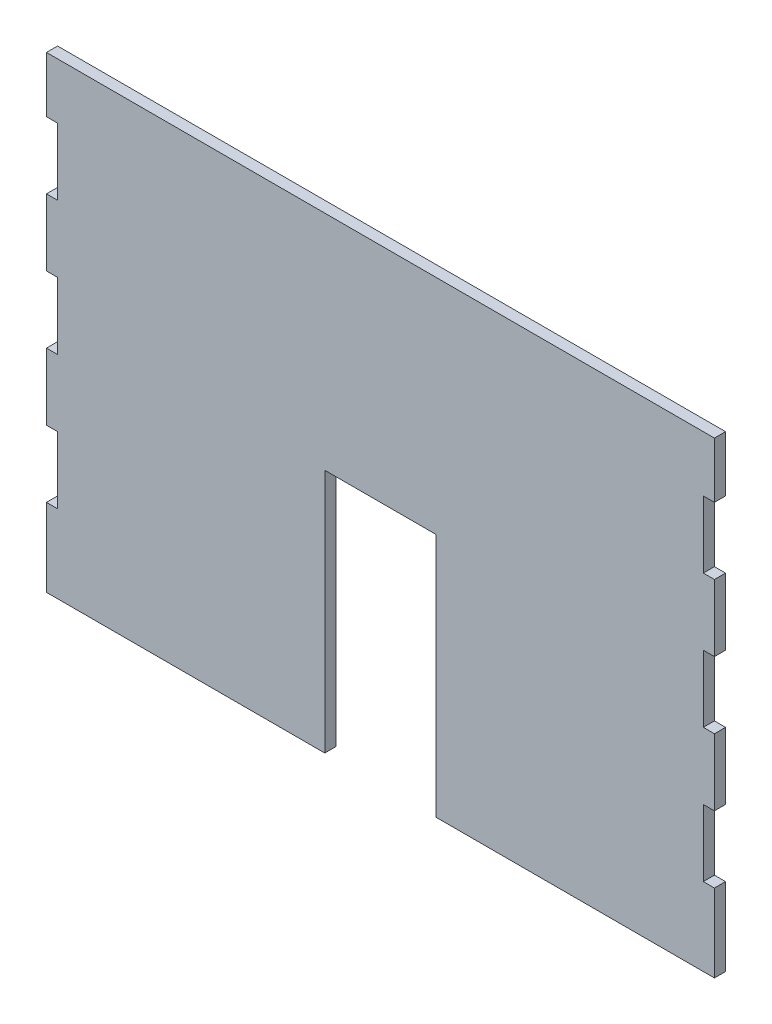
ISO-10303-21;
HEADER;
FILE_DESCRIPTION(('STEP AP214'),'2;1');
FILE_NAME('part.step','',(''),(''),'','','');
FILE_SCHEMA(('AUTOMOTIVE_DESIGN { 1 0 10303 214 1 1 1 1 }'));
ENDSEC;
DATA;
#1=APPLICATION_CONTEXT('core data for automotive mechanical design processes');
#2=APPLICATION_PROTOCOL_DEFINITION('international standard','automotive_design',2000,#1);
#3=PRODUCT_CONTEXT('',#1,'mechanical');
#4=PRODUCT('Part','Part','',(#3));
#5=PRODUCT_RELATED_PRODUCT_CATEGORY('part','',(#4));
#6=PRODUCT_DEFINITION_FORMATION('','',#4);
#7=PRODUCT_DEFINITION_CONTEXT('part definition',#1,'design');
#8=PRODUCT_DEFINITION('design','',#6,#7);
#9=PRODUCT_DEFINITION_SHAPE('','',#8);
#10=(LENGTH_UNIT() NAMED_UNIT(*) SI_UNIT(.MILLI.,.METRE.));
#11=(NAMED_UNIT(*) PLANE_ANGLE_UNIT() SI_UNIT($,.RADIAN.));
#12=(NAMED_UNIT(*) SI_UNIT($,.STERADIAN.) SOLID_ANGLE_UNIT());
#13=UNCERTAINTY_MEASURE_WITH_UNIT(LENGTH_MEASURE(1.E-05),#10,'distance_accuracy_value','');
#14=(GEOMETRIC_REPRESENTATION_CONTEXT(3) GLOBAL_UNCERTAINTY_ASSIGNED_CONTEXT((#13)) GLOBAL_UNIT_ASSIGNED_CONTEXT((#10,
#11,#12)) REPRESENTATION_CONTEXT('',''));
#15=CARTESIAN_POINT('',(0.,0.,0.));
#16=DIRECTION('',(0.,0.,1.));
#17=DIRECTION('',(1.,0.,0.));
#18=AXIS2_PLACEMENT_3D('',#15,#16,#17);
#19=CARTESIAN_POINT('',(-150.,-105.,5.));
#20=DIRECTION('',(0.,1.,0.));
#21=DIRECTION('',(0.,0.,1.));
#22=AXIS2_PLACEMENT_3D('',#19,#20,#21);
#23=PLANE('',#22);
#24=DIRECTION('',(1.,0.,0.));
#25=VECTOR('',#24,1.);
#26=CARTESIAN_POINT('',(-150.,-105.,5.));
#27=LINE('',#26,#25);
#28=CARTESIAN_POINT('',(25.,-105.,5.));
#29=VERTEX_POINT('',#28);
#30=CARTESIAN_POINT('',(150.,-105.,5.));
#31=VERTEX_POINT('',#30);
#32=EDGE_CURVE('E513',#29,#31,#27,.T.);
#33=ORIENTED_EDGE('',*,*,#32,.F.);
#34=DIRECTION('',(0.,0.,1.));
#35=VECTOR('',#34,1.);
#36=CARTESIAN_POINT('',(25.,-105.,0.));
#37=LINE('',#36,#35);
#38=CARTESIAN_POINT('',(25.,-105.,0.));
#39=VERTEX_POINT('',#38);
#40=EDGE_CURVE('E288',#39,#29,#37,.T.);
#41=ORIENTED_EDGE('',*,*,#40,.F.);
#42=DIRECTION('',(1.,0.,0.));
#43=VECTOR('',#42,1.);
#44=CARTESIAN_POINT('',(-150.,-105.,0.));
#45=LINE('',#44,#43);
#46=CARTESIAN_POINT('',(150.,-105.,0.));
#47=VERTEX_POINT('',#46);
#48=EDGE_CURVE('E274',#39,#47,#45,.T.);
#49=ORIENTED_EDGE('',*,*,#48,.T.);
#50=DIRECTION('',(0.,0.,-1.));
#51=VECTOR('',#50,1.);
#52=CARTESIAN_POINT('',(150.,-105.,5.));
#53=LINE('',#52,#51);
#54=EDGE_CURVE('E519',#31,#47,#53,.T.);
#55=ORIENTED_EDGE('',*,*,#54,.F.);
#56=EDGE_LOOP('',(#33,#41,#49,#55));
#57=FACE_BOUND('',#56,.T.);
#58=ADVANCED_FACE('F41',(#57),#23,.F.);
#59=CARTESIAN_POINT('',(150.,105.,5.));
#60=DIRECTION('',(-1.,0.,0.));
#61=DIRECTION('',(0.,-1.,0.));
#62=AXIS2_PLACEMENT_3D('',#59,#60,#61);
#63=PLANE('',#62);
#64=DIRECTION('',(0.,1.,0.));
#65=VECTOR('',#64,1.);
#66=CARTESIAN_POINT('',(150.,105.,0.));
#67=LINE('',#66,#65);
#68=CARTESIAN_POINT('',(150.,-40.,0.));
#69=VERTEX_POINT('',#68);
#70=CARTESIAN_POINT('',(150.,-10.,0.));
#71=VERTEX_POINT('',#70);
#72=EDGE_CURVE('E525',#69,#71,#67,.T.);
#73=ORIENTED_EDGE('',*,*,#72,.T.);
#74=DIRECTION('',(0.,0.,1.));
#75=VECTOR('',#74,1.);
#76=CARTESIAN_POINT('',(150.,-10.,5.));
#77=LINE('',#76,#75);
#78=CARTESIAN_POINT('',(150.,-10.,5.));
#79=VERTEX_POINT('',#78);
#80=EDGE_CURVE('E494',#71,#79,#77,.T.);
#81=ORIENTED_EDGE('',*,*,#80,.T.);
#82=DIRECTION('',(0.,1.,0.));
#83=VECTOR('',#82,1.);
#84=CARTESIAN_POINT('',(150.,105.,5.));
#85=LINE('',#84,#83);
#86=CARTESIAN_POINT('',(150.,-40.,5.));
#87=VERTEX_POINT('',#86);
#88=EDGE_CURVE('E504',#87,#79,#85,.T.);
#89=ORIENTED_EDGE('',*,*,#88,.F.);
#90=DIRECTION('',(0.,0.,-1.));
#91=VECTOR('',#90,1.);
#92=CARTESIAN_POINT('',(150.,-40.,5.));
#93=LINE('',#92,#91);
#94=EDGE_CURVE('E482',#87,#69,#93,.T.);
#95=ORIENTED_EDGE('',*,*,#94,.T.);
#96=EDGE_LOOP('',(#73,#81,#89,#95));
#97=FACE_BOUND('',#96,.T.);
#98=ADVANCED_FACE('F617',(#97),#63,.F.);
#99=CARTESIAN_POINT('',(150.,-70.,0.));
#100=VERTEX_POINT('',#99);
#101=EDGE_CURVE('E520',#47,#100,#67,.T.);
#102=ORIENTED_EDGE('',*,*,#101,.T.);
#103=DIRECTION('',(0.,0.,1.));
#104=VECTOR('',#103,1.);
#105=CARTESIAN_POINT('',(150.,-70.,5.));
#106=LINE('',#105,#104);
#107=CARTESIAN_POINT('',(150.,-70.,5.));
#108=VERTEX_POINT('',#107);
#109=EDGE_CURVE('E486',#100,#108,#106,.T.);
#110=ORIENTED_EDGE('',*,*,#109,.T.);
#111=EDGE_CURVE('E499',#31,#108,#85,.T.);
#112=ORIENTED_EDGE('',*,*,#111,.F.);
#113=ORIENTED_EDGE('',*,*,#54,.T.);
#114=EDGE_LOOP('',(#102,#110,#112,#113));
#115=FACE_BOUND('',#114,.T.);
#116=ADVANCED_FACE('F574',(#115),#63,.F.);
#117=CARTESIAN_POINT('',(150.,20.,5.));
#118=VERTEX_POINT('',#117);
#119=CARTESIAN_POINT('',(150.,50.,5.));
#120=VERTEX_POINT('',#119);
#121=EDGE_CURVE('E608',#118,#120,#85,.T.);
#122=ORIENTED_EDGE('',*,*,#121,.F.);
#123=DIRECTION('',(0.,0.,-1.));
#124=VECTOR('',#123,1.);
#125=CARTESIAN_POINT('',(150.,20.,5.));
#126=LINE('',#125,#124);
#127=CARTESIAN_POINT('',(150.,20.,0.));
#128=VERTEX_POINT('',#127);
#129=EDGE_CURVE('E490',#118,#128,#126,.T.);
#130=ORIENTED_EDGE('',*,*,#129,.T.);
#131=CARTESIAN_POINT('',(150.,50.,0.));
#132=VERTEX_POINT('',#131);
#133=EDGE_CURVE('E590',#128,#132,#67,.T.);
#134=ORIENTED_EDGE('',*,*,#133,.T.);
#135=DIRECTION('',(0.,0.,1.));
#136=VECTOR('',#135,1.);
#137=CARTESIAN_POINT('',(150.,50.,5.));
#138=LINE('',#137,#136);
#139=EDGE_CURVE('E454',#132,#120,#138,.T.);
#140=ORIENTED_EDGE('',*,*,#139,.T.);
#141=EDGE_LOOP('',(#122,#130,#134,#140));
#142=FACE_BOUND('',#141,.T.);
#143=ADVANCED_FACE('F627',(#142),#63,.F.);
#144=CARTESIAN_POINT('',(-150.,105.,5.));
#145=DIRECTION('',(1.,0.,0.));
#146=DIRECTION('',(0.,1.,0.));
#147=AXIS2_PLACEMENT_3D('',#144,#145,#146);
#148=PLANE('',#147);
#149=DIRECTION('',(0.,-1.,0.));
#150=VECTOR('',#149,1.);
#151=CARTESIAN_POINT('',(-150.,105.,5.));
#152=LINE('',#151,#150);
#153=CARTESIAN_POINT('',(-150.,50.,5.));
#154=VERTEX_POINT('',#153);
#155=CARTESIAN_POINT('',(-150.,20.,5.));
#156=VERTEX_POINT('',#155);
#157=EDGE_CURVE('E514',#154,#156,#152,.T.);
#158=ORIENTED_EDGE('',*,*,#157,.F.);
#159=DIRECTION('',(0.,0.,-1.));
#160=VECTOR('',#159,1.);
#161=CARTESIAN_POINT('',(-150.,50.,5.));
#162=LINE('',#161,#160);
#163=CARTESIAN_POINT('',(-150.,50.,0.));
#164=VERTEX_POINT('',#163);
#165=EDGE_CURVE('E478',#154,#164,#162,.T.);
#166=ORIENTED_EDGE('',*,*,#165,.T.);
#167=DIRECTION('',(0.,-1.,0.));
#168=VECTOR('',#167,1.);
#169=CARTESIAN_POINT('',(-150.,105.,0.));
#170=LINE('',#169,#168);
#171=CARTESIAN_POINT('',(-150.,20.,0.));
#172=VERTEX_POINT('',#171);
#173=EDGE_CURVE('E533',#164,#172,#170,.T.);
#174=ORIENTED_EDGE('',*,*,#173,.T.);
#175=DIRECTION('',(0.,0.,1.));
#176=VECTOR('',#175,1.);
#177=CARTESIAN_POINT('',(-150.,20.,5.));
#178=LINE('',#177,#176);
#179=EDGE_CURVE('E466',#172,#156,#178,.T.);
#180=ORIENTED_EDGE('',*,*,#179,.T.);
#181=EDGE_LOOP('',(#158,#166,#174,#180));
#182=FACE_BOUND('',#181,.T.);
#183=ADVANCED_FACE('F662',(#182),#148,.F.);
#184=CARTESIAN_POINT('',(-150.,-10.,5.));
#185=VERTEX_POINT('',#184);
#186=CARTESIAN_POINT('',(-150.,-40.,5.));
#187=VERTEX_POINT('',#186);
#188=EDGE_CURVE('E684',#185,#187,#152,.T.);
#189=ORIENTED_EDGE('',*,*,#188,.F.);
#190=DIRECTION('',(0.,0.,-1.));
#191=VECTOR('',#190,1.);
#192=CARTESIAN_POINT('',(-150.,-10.,5.));
#193=LINE('',#192,#191);
#194=CARTESIAN_POINT('',(-150.,-10.,0.));
#195=VERTEX_POINT('',#194);
#196=EDGE_CURVE('E470',#185,#195,#193,.T.);
#197=ORIENTED_EDGE('',*,*,#196,.T.);
#198=CARTESIAN_POINT('',(-150.,-40.,0.));
#199=VERTEX_POINT('',#198);
#200=EDGE_CURVE('E584',#195,#199,#170,.T.);
#201=ORIENTED_EDGE('',*,*,#200,.T.);
#202=DIRECTION('',(0.,0.,1.));
#203=VECTOR('',#202,1.);
#204=CARTESIAN_POINT('',(-150.,-40.,5.));
#205=LINE('',#204,#203);
#206=EDGE_CURVE('E458',#199,#187,#205,.T.);
#207=ORIENTED_EDGE('',*,*,#206,.T.);
#208=EDGE_LOOP('',(#189,#197,#201,#207));
#209=FACE_BOUND('',#208,.T.);
#210=ADVANCED_FACE('F683',(#209),#148,.F.);
#211=CARTESIAN_POINT('',(-150.,-70.,5.));
#212=VERTEX_POINT('',#211);
#213=CARTESIAN_POINT('',(-150.,-105.,5.));
#214=VERTEX_POINT('',#213);
#215=EDGE_CURVE('E508',#212,#214,#152,.T.);
#216=ORIENTED_EDGE('',*,*,#215,.F.);
#217=DIRECTION('',(0.,0.,-1.));
#218=VECTOR('',#217,1.);
#219=CARTESIAN_POINT('',(-150.,-70.,5.));
#220=LINE('',#219,#218);
#221=CARTESIAN_POINT('',(-150.,-70.,0.));
#222=VERTEX_POINT('',#221);
#223=EDGE_CURVE('E462',#212,#222,#220,.T.);
#224=ORIENTED_EDGE('',*,*,#223,.T.);
#225=CARTESIAN_POINT('',(-150.,-105.,0.));
#226=VERTEX_POINT('',#225);
#227=EDGE_CURVE('E528',#222,#226,#170,.T.);
#228=ORIENTED_EDGE('',*,*,#227,.T.);
#229=DIRECTION('',(0.,0.,-1.));
#230=VECTOR('',#229,1.);
#231=CARTESIAN_POINT('',(-150.,-105.,5.));
#232=LINE('',#231,#230);
#233=EDGE_CURVE('E541',#214,#226,#232,.T.);
#234=ORIENTED_EDGE('',*,*,#233,.F.);
#235=EDGE_LOOP('',(#216,#224,#228,#234));
#236=FACE_BOUND('',#235,.T.);
#237=ADVANCED_FACE('F663',(#236),#148,.F.);
#238=CARTESIAN_POINT('',(150.,80.,5.));
#239=VERTEX_POINT('',#238);
#240=CARTESIAN_POINT('',(150.,105.,5.));
#241=VERTEX_POINT('',#240);
#242=EDGE_CURVE('E505',#239,#241,#85,.T.);
#243=ORIENTED_EDGE('',*,*,#242,.F.);
#244=DIRECTION('',(0.,0.,-1.));
#245=VECTOR('',#244,1.);
#246=CARTESIAN_POINT('',(150.,80.,5.));
#247=LINE('',#246,#245);
#248=CARTESIAN_POINT('',(150.,80.,0.));
#249=VERTEX_POINT('',#248);
#250=EDGE_CURVE('E447',#239,#249,#247,.T.);
#251=ORIENTED_EDGE('',*,*,#250,.T.);
#252=CARTESIAN_POINT('',(150.,105.,0.));
#253=VERTEX_POINT('',#252);
#254=EDGE_CURVE('E498',#249,#253,#67,.T.);
#255=ORIENTED_EDGE('',*,*,#254,.T.);
#256=DIRECTION('',(0.,0.,-1.));
#257=VECTOR('',#256,1.);
#258=CARTESIAN_POINT('',(150.,105.,5.));
#259=LINE('',#258,#257);
#260=EDGE_CURVE('E549',#241,#253,#259,.T.);
#261=ORIENTED_EDGE('',*,*,#260,.F.);
#262=EDGE_LOOP('',(#243,#251,#255,#261));
#263=FACE_BOUND('',#262,.T.);
#264=ADVANCED_FACE('F43',(#263),#63,.F.);
#265=CARTESIAN_POINT('',(-150.,105.,5.));
#266=DIRECTION('',(0.,-1.,0.));
#267=DIRECTION('',(0.,0.,-1.));
#268=AXIS2_PLACEMENT_3D('',#265,#266,#267);
#269=PLANE('',#268);
#270=DIRECTION('',(-1.,0.,0.));
#271=VECTOR('',#270,1.);
#272=CARTESIAN_POINT('',(-150.,105.,0.));
#273=LINE('',#272,#271);
#274=CARTESIAN_POINT('',(-150.,105.,0.));
#275=VERTEX_POINT('',#274);
#276=EDGE_CURVE('E524',#253,#275,#273,.T.);
#277=ORIENTED_EDGE('',*,*,#276,.T.);
#278=DIRECTION('',(0.,0.,-1.));
#279=VECTOR('',#278,1.);
#280=CARTESIAN_POINT('',(-150.,105.,5.));
#281=LINE('',#280,#279);
#282=CARTESIAN_POINT('',(-150.,105.,5.));
#283=VERTEX_POINT('',#282);
#284=EDGE_CURVE('E545',#283,#275,#281,.T.);
#285=ORIENTED_EDGE('',*,*,#284,.F.);
#286=DIRECTION('',(-1.,0.,0.));
#287=VECTOR('',#286,1.);
#288=CARTESIAN_POINT('',(-150.,105.,5.));
#289=LINE('',#288,#287);
#290=EDGE_CURVE('E503',#241,#283,#289,.T.);
#291=ORIENTED_EDGE('',*,*,#290,.F.);
#292=ORIENTED_EDGE('',*,*,#260,.T.);
#293=EDGE_LOOP('',(#277,#285,#291,#292));
#294=FACE_BOUND('',#293,.T.);
#295=ADVANCED_FACE('F603',(#294),#269,.F.);
#296=CARTESIAN_POINT('',(-150.,80.,0.));
#297=VERTEX_POINT('',#296);
#298=EDGE_CURVE('E529',#275,#297,#170,.T.);
#299=ORIENTED_EDGE('',*,*,#298,.T.);
#300=DIRECTION('',(0.,0.,1.));
#301=VECTOR('',#300,1.);
#302=CARTESIAN_POINT('',(-150.,80.,5.));
#303=LINE('',#302,#301);
#304=CARTESIAN_POINT('',(-150.,80.,5.));
#305=VERTEX_POINT('',#304);
#306=EDGE_CURVE('E474',#297,#305,#303,.T.);
#307=ORIENTED_EDGE('',*,*,#306,.T.);
#308=EDGE_CURVE('E509',#283,#305,#152,.T.);
#309=ORIENTED_EDGE('',*,*,#308,.F.);
#310=ORIENTED_EDGE('',*,*,#284,.T.);
#311=EDGE_LOOP('',(#299,#307,#309,#310));
#312=FACE_BOUND('',#311,.T.);
#313=ADVANCED_FACE('F654',(#312),#148,.F.);
#314=CARTESIAN_POINT('',(-25.,-105.,0.));
#315=VERTEX_POINT('',#314);
#316=EDGE_CURVE('E534',#226,#315,#45,.T.);
#317=ORIENTED_EDGE('',*,*,#316,.T.);
#318=DIRECTION('',(0.,0.,1.));
#319=VECTOR('',#318,1.);
#320=CARTESIAN_POINT('',(-25.,-105.,0.));
#321=LINE('',#320,#319);
#322=CARTESIAN_POINT('',(-25.,-105.,5.));
#323=VERTEX_POINT('',#322);
#324=EDGE_CURVE('E292',#315,#323,#321,.T.);
#325=ORIENTED_EDGE('',*,*,#324,.T.);
#326=EDGE_CURVE('E515',#214,#323,#27,.T.);
#327=ORIENTED_EDGE('',*,*,#326,.F.);
#328=ORIENTED_EDGE('',*,*,#233,.T.);
#329=EDGE_LOOP('',(#317,#325,#327,#328));
#330=FACE_BOUND('',#329,.T.);
#331=ADVANCED_FACE('F647',(#330),#23,.F.);
#332=CARTESIAN_POINT('',(0.,0.,5.));
#333=DIRECTION('',(0.,0.,1.));
#334=DIRECTION('',(1.,0.,0.));
#335=AXIS2_PLACEMENT_3D('',#332,#333,#334);
#336=PLANE('',#335);
#337=DIRECTION('',(0.,1.,0.));
#338=VECTOR('',#337,1.);
#339=CARTESIAN_POINT('',(25.,4.99999999999999,5.));
#340=LINE('',#339,#338);
#341=CARTESIAN_POINT('',(25.,4.99999999999999,5.));
#342=VERTEX_POINT('',#341);
#343=EDGE_CURVE('E258',#29,#342,#340,.T.);
#344=ORIENTED_EDGE('',*,*,#343,.F.);
#345=ORIENTED_EDGE('',*,*,#32,.T.);
#346=ORIENTED_EDGE('',*,*,#111,.T.);
#347=DIRECTION('',(-1.,0.,0.));
#348=VECTOR('',#347,1.);
#349=CARTESIAN_POINT('',(217.619836515583,-70.,5.));
#350=LINE('',#349,#348);
#351=CARTESIAN_POINT('',(145.,-70.,5.));
#352=VERTEX_POINT('',#351);
#353=EDGE_CURVE('E358',#108,#352,#350,.T.);
#354=ORIENTED_EDGE('',*,*,#353,.T.);
#355=DIRECTION('',(0.,1.,0.));
#356=VECTOR('',#355,1.);
#357=CARTESIAN_POINT('',(145.,-70.,5.));
#358=LINE('',#357,#356);
#359=CARTESIAN_POINT('',(145.,-40.,5.));
#360=VERTEX_POINT('',#359);
#361=EDGE_CURVE('E349',#352,#360,#358,.T.);
#362=ORIENTED_EDGE('',*,*,#361,.T.);
#363=DIRECTION('',(1.,0.,0.));
#364=VECTOR('',#363,1.);
#365=CARTESIAN_POINT('',(217.619836515583,-40.,5.));
#366=LINE('',#365,#364);
#367=EDGE_CURVE('E353',#360,#87,#366,.T.);
#368=ORIENTED_EDGE('',*,*,#367,.T.);
#369=ORIENTED_EDGE('',*,*,#88,.T.);
#370=DIRECTION('',(-1.,0.,0.));
#371=VECTOR('',#370,1.);
#372=CARTESIAN_POINT('',(217.619836515583,-10.,5.));
#373=LINE('',#372,#371);
#374=CARTESIAN_POINT('',(145.,-10.,5.));
#375=VERTEX_POINT('',#374);
#376=EDGE_CURVE('E333',#79,#375,#373,.T.);
#377=ORIENTED_EDGE('',*,*,#376,.T.);
#378=DIRECTION('',(0.,1.,0.));
#379=VECTOR('',#378,1.);
#380=CARTESIAN_POINT('',(145.,20.,5.));
#381=LINE('',#380,#379);
#382=CARTESIAN_POINT('',(145.,20.,5.));
#383=VERTEX_POINT('',#382);
#384=EDGE_CURVE('E324',#375,#383,#381,.T.);
#385=ORIENTED_EDGE('',*,*,#384,.T.);
#386=DIRECTION('',(1.,0.,0.));
#387=VECTOR('',#386,1.);
#388=CARTESIAN_POINT('',(217.619836515583,20.,5.));
#389=LINE('',#388,#387);
#390=EDGE_CURVE('E328',#383,#118,#389,.T.);
#391=ORIENTED_EDGE('',*,*,#390,.T.);
#392=ORIENTED_EDGE('',*,*,#121,.T.);
#393=DIRECTION('',(-1.,0.,0.));
#394=VECTOR('',#393,1.);
#395=CARTESIAN_POINT('',(212.619836515583,50.,5.));
#396=LINE('',#395,#394);
#397=CARTESIAN_POINT('',(145.,50.,5.));
#398=VERTEX_POINT('',#397);
#399=EDGE_CURVE('E434',#120,#398,#396,.T.);
#400=ORIENTED_EDGE('',*,*,#399,.T.);
#401=DIRECTION('',(0.,1.,0.));
#402=VECTOR('',#401,1.);
#403=CARTESIAN_POINT('',(145.,80.,5.));
#404=LINE('',#403,#402);
#405=CARTESIAN_POINT('',(145.,80.,5.));
#406=VERTEX_POINT('',#405);
#407=EDGE_CURVE('E425',#398,#406,#404,.T.);
#408=ORIENTED_EDGE('',*,*,#407,.T.);
#409=DIRECTION('',(1.,0.,0.));
#410=VECTOR('',#409,1.);
#411=CARTESIAN_POINT('',(212.619836515583,80.,5.));
#412=LINE('',#411,#410);
#413=EDGE_CURVE('E429',#406,#239,#412,.T.);
#414=ORIENTED_EDGE('',*,*,#413,.T.);
#415=ORIENTED_EDGE('',*,*,#242,.T.);
#416=ORIENTED_EDGE('',*,*,#290,.T.);
#417=ORIENTED_EDGE('',*,*,#308,.T.);
#418=DIRECTION('',(1.,0.,0.));
#419=VECTOR('',#418,1.);
#420=CARTESIAN_POINT('',(-145.,80.,5.));
#421=LINE('',#420,#419);
#422=CARTESIAN_POINT('',(-145.,80.,5.));
#423=VERTEX_POINT('',#422);
#424=EDGE_CURVE('E375',#305,#423,#421,.T.);
#425=ORIENTED_EDGE('',*,*,#424,.T.);
#426=DIRECTION('',(0.,-1.,0.));
#427=VECTOR('',#426,1.);
#428=CARTESIAN_POINT('',(-145.,80.,5.));
#429=LINE('',#428,#427);
#430=CARTESIAN_POINT('',(-145.,50.,5.));
#431=VERTEX_POINT('',#430);
#432=EDGE_CURVE('E379',#423,#431,#429,.T.);
#433=ORIENTED_EDGE('',*,*,#432,.T.);
#434=DIRECTION('',(-1.,0.,0.));
#435=VECTOR('',#434,1.);
#436=CARTESIAN_POINT('',(-145.,50.,5.));
#437=LINE('',#436,#435);
#438=EDGE_CURVE('E384',#431,#154,#437,.T.);
#439=ORIENTED_EDGE('',*,*,#438,.T.);
#440=ORIENTED_EDGE('',*,*,#157,.T.);
#441=DIRECTION('',(1.,0.,0.));
#442=VECTOR('',#441,1.);
#443=CARTESIAN_POINT('',(-145.,20.,5.));
#444=LINE('',#443,#442);
#445=CARTESIAN_POINT('',(-145.,20.,5.));
#446=VERTEX_POINT('',#445);
#447=EDGE_CURVE('E401',#156,#446,#444,.T.);
#448=ORIENTED_EDGE('',*,*,#447,.T.);
#449=DIRECTION('',(0.,-1.,0.));
#450=VECTOR('',#449,1.);
#451=CARTESIAN_POINT('',(-145.,20.,5.));
#452=LINE('',#451,#450);
#453=CARTESIAN_POINT('',(-145.,-10.,5.));
#454=VERTEX_POINT('',#453);
#455=EDGE_CURVE('E405',#446,#454,#452,.T.);
#456=ORIENTED_EDGE('',*,*,#455,.T.);
#457=DIRECTION('',(-1.,0.,0.));
#458=VECTOR('',#457,1.);
#459=CARTESIAN_POINT('',(-145.,-10.,5.));
#460=LINE('',#459,#458);
#461=EDGE_CURVE('E410',#454,#185,#460,.T.);
#462=ORIENTED_EDGE('',*,*,#461,.T.);
#463=ORIENTED_EDGE('',*,*,#188,.T.);
#464=DIRECTION('',(1.,0.,0.));
#465=VECTOR('',#464,1.);
#466=CARTESIAN_POINT('',(-145.,-40.,5.));
#467=LINE('',#466,#465);
#468=CARTESIAN_POINT('',(-145.,-40.,5.));
#469=VERTEX_POINT('',#468);
#470=EDGE_CURVE('E298',#187,#469,#467,.T.);
#471=ORIENTED_EDGE('',*,*,#470,.T.);
#472=DIRECTION('',(0.,-1.,0.));
#473=VECTOR('',#472,1.);
#474=CARTESIAN_POINT('',(-145.,-70.,5.));
#475=LINE('',#474,#473);
#476=CARTESIAN_POINT('',(-145.,-70.,5.));
#477=VERTEX_POINT('',#476);
#478=EDGE_CURVE('E302',#469,#477,#475,.T.);
#479=ORIENTED_EDGE('',*,*,#478,.T.);
#480=DIRECTION('',(-1.,0.,0.));
#481=VECTOR('',#480,1.);
#482=CARTESIAN_POINT('',(-145.,-70.,5.));
#483=LINE('',#482,#481);
#484=EDGE_CURVE('E307',#477,#212,#483,.T.);
#485=ORIENTED_EDGE('',*,*,#484,.T.);
#486=ORIENTED_EDGE('',*,*,#215,.T.);
#487=ORIENTED_EDGE('',*,*,#326,.T.);
#488=DIRECTION('',(0.,-1.,0.));
#489=VECTOR('',#488,1.);
#490=CARTESIAN_POINT('',(-25.,4.99999999999999,5.));
#491=LINE('',#490,#489);
#492=CARTESIAN_POINT('',(-25.,4.99999999999999,5.));
#493=VERTEX_POINT('',#492);
#494=EDGE_CURVE('E276',#493,#323,#491,.T.);
#495=ORIENTED_EDGE('',*,*,#494,.F.);
#496=DIRECTION('',(-1.,0.,0.));
#497=VECTOR('',#496,1.);
#498=CARTESIAN_POINT('',(-25.,4.99999999999999,5.));
#499=LINE('',#498,#497);
#500=EDGE_CURVE('E279',#342,#493,#499,.T.);
#501=ORIENTED_EDGE('',*,*,#500,.F.);
#502=EDGE_LOOP('',(#344,#345,#346,#354,#362,#368,#369,#377,#385,#391,#392,#400,#408,#414,#415,
#416,#417,#425,#433,#439,#440,#448,#456,#462,#463,#471,#479,#485,#486,#487,#495,#501));
#503=FACE_BOUND('',#502,.T.);
#504=ADVANCED_FACE('F606',(#503),#336,.T.);
#505=CARTESIAN_POINT('',(0.,0.,0.));
#506=DIRECTION('',(0.,0.,1.));
#507=DIRECTION('',(1.,0.,0.));
#508=AXIS2_PLACEMENT_3D('',#505,#506,#507);
#509=PLANE('',#508);
#510=ORIENTED_EDGE('',*,*,#48,.F.);
#511=DIRECTION('',(0.,1.,0.));
#512=VECTOR('',#511,1.);
#513=CARTESIAN_POINT('',(25.,4.99999999999999,0.));
#514=LINE('',#513,#512);
#515=CARTESIAN_POINT('',(25.,4.99999999999999,0.));
#516=VERTEX_POINT('',#515);
#517=EDGE_CURVE('E255',#39,#516,#514,.T.);
#518=ORIENTED_EDGE('',*,*,#517,.T.);
#519=DIRECTION('',(-1.,0.,0.));
#520=VECTOR('',#519,1.);
#521=CARTESIAN_POINT('',(-25.,4.99999999999999,0.));
#522=LINE('',#521,#520);
#523=CARTESIAN_POINT('',(-25.,4.99999999999999,0.));
#524=VERTEX_POINT('',#523);
#525=EDGE_CURVE('E266',#516,#524,#522,.T.);
#526=ORIENTED_EDGE('',*,*,#525,.T.);
#527=DIRECTION('',(0.,-1.,0.));
#528=VECTOR('',#527,1.);
#529=CARTESIAN_POINT('',(-25.,4.99999999999999,0.));
#530=LINE('',#529,#528);
#531=EDGE_CURVE('E57',#524,#315,#530,.T.);
#532=ORIENTED_EDGE('',*,*,#531,.T.);
#533=ORIENTED_EDGE('',*,*,#316,.F.);
#534=ORIENTED_EDGE('',*,*,#227,.F.);
#535=DIRECTION('',(-1.,0.,0.));
#536=VECTOR('',#535,1.);
#537=CARTESIAN_POINT('',(-145.,-70.,0.));
#538=LINE('',#537,#536);
#539=CARTESIAN_POINT('',(-145.,-70.,0.));
#540=VERTEX_POINT('',#539);
#541=EDGE_CURVE('E303',#540,#222,#538,.T.);
#542=ORIENTED_EDGE('',*,*,#541,.F.);
#543=DIRECTION('',(0.,-1.,0.));
#544=VECTOR('',#543,1.);
#545=CARTESIAN_POINT('',(-145.,-70.,0.));
#546=LINE('',#545,#544);
#547=CARTESIAN_POINT('',(-145.,-40.,0.));
#548=VERTEX_POINT('',#547);
#549=EDGE_CURVE('E291',#548,#540,#546,.T.);
#550=ORIENTED_EDGE('',*,*,#549,.F.);
#551=DIRECTION('',(-1.,0.,0.));
#552=VECTOR('',#551,1.);
#553=CARTESIAN_POINT('',(0.,-40.,0.));
#554=LINE('',#553,#552);
#555=EDGE_CURVE('E557',#548,#199,#554,.T.);
#556=ORIENTED_EDGE('',*,*,#555,.T.);
#557=ORIENTED_EDGE('',*,*,#200,.F.);
#558=DIRECTION('',(-1.,0.,0.));
#559=VECTOR('',#558,1.);
#560=CARTESIAN_POINT('',(-145.,-10.,0.));
#561=LINE('',#560,#559);
#562=CARTESIAN_POINT('',(-145.,-10.,0.));
#563=VERTEX_POINT('',#562);
#564=EDGE_CURVE('E406',#563,#195,#561,.T.);
#565=ORIENTED_EDGE('',*,*,#564,.F.);
#566=DIRECTION('',(0.,-1.,0.));
#567=VECTOR('',#566,1.);
#568=CARTESIAN_POINT('',(-145.,20.,0.));
#569=LINE('',#568,#567);
#570=CARTESIAN_POINT('',(-145.,20.,0.));
#571=VERTEX_POINT('',#570);
#572=EDGE_CURVE('E320',#571,#563,#569,.T.);
#573=ORIENTED_EDGE('',*,*,#572,.F.);
#574=DIRECTION('',(-1.,0.,0.));
#575=VECTOR('',#574,1.);
#576=CARTESIAN_POINT('',(0.,20.,0.));
#577=LINE('',#576,#575);
#578=EDGE_CURVE('E561',#571,#172,#577,.T.);
#579=ORIENTED_EDGE('',*,*,#578,.T.);
#580=ORIENTED_EDGE('',*,*,#173,.F.);
#581=DIRECTION('',(-1.,0.,0.));
#582=VECTOR('',#581,1.);
#583=CARTESIAN_POINT('',(-145.,50.,0.));
#584=LINE('',#583,#582);
#585=CARTESIAN_POINT('',(-145.,50.,0.));
#586=VERTEX_POINT('',#585);
#587=EDGE_CURVE('E380',#586,#164,#584,.T.);
#588=ORIENTED_EDGE('',*,*,#587,.F.);
#589=DIRECTION('',(0.,-1.,0.));
#590=VECTOR('',#589,1.);
#591=CARTESIAN_POINT('',(-145.,80.,0.));
#592=LINE('',#591,#590);
#593=CARTESIAN_POINT('',(-145.,80.,0.));
#594=VERTEX_POINT('',#593);
#595=EDGE_CURVE('E389',#594,#586,#592,.T.);
#596=ORIENTED_EDGE('',*,*,#595,.F.);
#597=DIRECTION('',(-1.,0.,0.));
#598=VECTOR('',#597,1.);
#599=CARTESIAN_POINT('',(0.,80.,0.));
#600=LINE('',#599,#598);
#601=EDGE_CURVE('E565',#594,#297,#600,.T.);
#602=ORIENTED_EDGE('',*,*,#601,.T.);
#603=ORIENTED_EDGE('',*,*,#298,.F.);
#604=ORIENTED_EDGE('',*,*,#276,.F.);
#605=ORIENTED_EDGE('',*,*,#254,.F.);
#606=DIRECTION('',(1.,0.,0.));
#607=VECTOR('',#606,1.);
#608=CARTESIAN_POINT('',(212.619836515583,80.,0.));
#609=LINE('',#608,#607);
#610=CARTESIAN_POINT('',(145.,80.,0.));
#611=VERTEX_POINT('',#610);
#612=EDGE_CURVE('E430',#611,#249,#609,.T.);
#613=ORIENTED_EDGE('',*,*,#612,.F.);
#614=DIRECTION('',(0.,1.,0.));
#615=VECTOR('',#614,1.);
#616=CARTESIAN_POINT('',(145.,80.,0.));
#617=LINE('',#616,#615);
#618=CARTESIAN_POINT('',(145.,50.,0.));
#619=VERTEX_POINT('',#618);
#620=EDGE_CURVE('E346',#619,#611,#617,.T.);
#621=ORIENTED_EDGE('',*,*,#620,.F.);
#622=DIRECTION('',(1.,0.,0.));
#623=VECTOR('',#622,1.);
#624=CARTESIAN_POINT('',(0.,50.,0.));
#625=LINE('',#624,#623);
#626=EDGE_CURVE('E553',#619,#132,#625,.T.);
#627=ORIENTED_EDGE('',*,*,#626,.T.);
#628=ORIENTED_EDGE('',*,*,#133,.F.);
#629=DIRECTION('',(1.,0.,0.));
#630=VECTOR('',#629,1.);
#631=CARTESIAN_POINT('',(217.619836515583,20.,0.));
#632=LINE('',#631,#630);
#633=CARTESIAN_POINT('',(145.,20.,0.));
#634=VERTEX_POINT('',#633);
#635=EDGE_CURVE('E329',#634,#128,#632,.T.);
#636=ORIENTED_EDGE('',*,*,#635,.F.);
#637=DIRECTION('',(0.,1.,0.));
#638=VECTOR('',#637,1.);
#639=CARTESIAN_POINT('',(145.,20.,0.));
#640=LINE('',#639,#638);
#641=CARTESIAN_POINT('',(145.,-10.,0.));
#642=VERTEX_POINT('',#641);
#643=EDGE_CURVE('E65',#642,#634,#640,.T.);
#644=ORIENTED_EDGE('',*,*,#643,.F.);
#645=DIRECTION('',(1.,0.,0.));
#646=VECTOR('',#645,1.);
#647=CARTESIAN_POINT('',(0.,-10.,0.));
#648=LINE('',#647,#646);
#649=EDGE_CURVE('E11',#642,#71,#648,.T.);
#650=ORIENTED_EDGE('',*,*,#649,.T.);
#651=ORIENTED_EDGE('',*,*,#72,.F.);
#652=DIRECTION('',(1.,0.,0.));
#653=VECTOR('',#652,1.);
#654=CARTESIAN_POINT('',(217.619836515583,-40.,0.));
#655=LINE('',#654,#653);
#656=CARTESIAN_POINT('',(145.,-40.,0.));
#657=VERTEX_POINT('',#656);
#658=EDGE_CURVE('E354',#657,#69,#655,.T.);
#659=ORIENTED_EDGE('',*,*,#658,.F.);
#660=DIRECTION('',(0.,1.,0.));
#661=VECTOR('',#660,1.);
#662=CARTESIAN_POINT('',(145.,-70.,0.));
#663=LINE('',#662,#661);
#664=CARTESIAN_POINT('',(145.,-70.,0.));
#665=VERTEX_POINT('',#664);
#666=EDGE_CURVE('E363',#665,#657,#663,.T.);
#667=ORIENTED_EDGE('',*,*,#666,.F.);
#668=DIRECTION('',(1.,0.,0.));
#669=VECTOR('',#668,1.);
#670=CARTESIAN_POINT('',(0.,-70.,0.));
#671=LINE('',#670,#669);
#672=EDGE_CURVE('E50',#665,#100,#671,.T.);
#673=ORIENTED_EDGE('',*,*,#672,.T.);
#674=ORIENTED_EDGE('',*,*,#101,.F.);
#675=EDGE_LOOP('',(#510,#518,#526,#532,#533,#534,#542,#550,#556,#557,#565,#573,#579,#580,#588,
#596,#602,#603,#604,#605,#613,#621,#627,#628,#636,#644,#650,#651,#659,#667,#673,#674));
#676=FACE_BOUND('',#675,.T.);
#677=ADVANCED_FACE('F272',(#676),#509,.F.);
#678=CARTESIAN_POINT('',(212.619836515583,50.,5.));
#679=DIRECTION('',(0.,-1.,0.));
#680=DIRECTION('',(0.,0.,-1.));
#681=AXIS2_PLACEMENT_3D('',#678,#679,#680);
#682=PLANE('',#681);
#683=ORIENTED_EDGE('',*,*,#626,.F.);
#684=DIRECTION('',(0.,0.,-1.));
#685=VECTOR('',#684,1.);
#686=CARTESIAN_POINT('',(145.,50.,5.));
#687=LINE('',#686,#685);
#688=EDGE_CURVE('E443',#398,#619,#687,.T.);
#689=ORIENTED_EDGE('',*,*,#688,.F.);
#690=ORIENTED_EDGE('',*,*,#399,.F.);
#691=ORIENTED_EDGE('',*,*,#139,.F.);
#692=EDGE_LOOP('',(#683,#689,#690,#691));
#693=FACE_BOUND('',#692,.T.);
#694=ADVANCED_FACE('F629',(#693),#682,.F.);
#695=CARTESIAN_POINT('',(212.619836515583,80.,5.));
#696=DIRECTION('',(0.,1.,0.));
#697=DIRECTION('',(0.,0.,1.));
#698=AXIS2_PLACEMENT_3D('',#695,#696,#697);
#699=PLANE('',#698);
#700=ORIENTED_EDGE('',*,*,#413,.F.);
#701=DIRECTION('',(0.,0.,-1.));
#702=VECTOR('',#701,1.);
#703=CARTESIAN_POINT('',(145.,80.,5.));
#704=LINE('',#703,#702);
#705=EDGE_CURVE('E438',#406,#611,#704,.T.);
#706=ORIENTED_EDGE('',*,*,#705,.T.);
#707=ORIENTED_EDGE('',*,*,#612,.T.);
#708=ORIENTED_EDGE('',*,*,#250,.F.);
#709=EDGE_LOOP('',(#700,#706,#707,#708));
#710=FACE_BOUND('',#709,.T.);
#711=ADVANCED_FACE('F635',(#710),#699,.F.);
#712=CARTESIAN_POINT('',(145.,80.,5.));
#713=DIRECTION('',(-1.,0.,0.));
#714=DIRECTION('',(0.,0.,1.));
#715=AXIS2_PLACEMENT_3D('',#712,#713,#714);
#716=PLANE('',#715);
#717=ORIENTED_EDGE('',*,*,#620,.T.);
#718=ORIENTED_EDGE('',*,*,#705,.F.);
#719=ORIENTED_EDGE('',*,*,#407,.F.);
#720=ORIENTED_EDGE('',*,*,#688,.T.);
#721=EDGE_LOOP('',(#717,#718,#719,#720));
#722=FACE_BOUND('',#721,.T.);
#723=ADVANCED_FACE('F632',(#722),#716,.F.);
#724=CARTESIAN_POINT('',(-145.,-70.,5.));
#725=DIRECTION('',(0.,-1.,0.));
#726=DIRECTION('',(0.,0.,-1.));
#727=AXIS2_PLACEMENT_3D('',#724,#725,#726);
#728=PLANE('',#727);
#729=ORIENTED_EDGE('',*,*,#484,.F.);
#730=DIRECTION('',(0.,0.,-1.));
#731=VECTOR('',#730,1.);
#732=CARTESIAN_POINT('',(-145.,-70.,5.));
#733=LINE('',#732,#731);
#734=EDGE_CURVE('E317',#477,#540,#733,.T.);
#735=ORIENTED_EDGE('',*,*,#734,.T.);
#736=ORIENTED_EDGE('',*,*,#541,.T.);
#737=ORIENTED_EDGE('',*,*,#223,.F.);
#738=EDGE_LOOP('',(#729,#735,#736,#737));
#739=FACE_BOUND('',#738,.T.);
#740=ADVANCED_FACE('F642',(#739),#728,.F.);
#741=CARTESIAN_POINT('',(-145.,-40.,5.));
#742=DIRECTION('',(0.,1.,0.));
#743=DIRECTION('',(0.,0.,1.));
#744=AXIS2_PLACEMENT_3D('',#741,#742,#743);
#745=PLANE('',#744);
#746=ORIENTED_EDGE('',*,*,#555,.F.);
#747=DIRECTION('',(0.,0.,-1.));
#748=VECTOR('',#747,1.);
#749=CARTESIAN_POINT('',(-145.,-40.,5.));
#750=LINE('',#749,#748);
#751=EDGE_CURVE('E311',#469,#548,#750,.T.);
#752=ORIENTED_EDGE('',*,*,#751,.F.);
#753=ORIENTED_EDGE('',*,*,#470,.F.);
#754=ORIENTED_EDGE('',*,*,#206,.F.);
#755=EDGE_LOOP('',(#746,#752,#753,#754));
#756=FACE_BOUND('',#755,.T.);
#757=ADVANCED_FACE('F854',(#756),#745,.F.);
#758=CARTESIAN_POINT('',(-145.,-70.,5.));
#759=DIRECTION('',(1.,0.,0.));
#760=DIRECTION('',(0.,0.,-1.));
#761=AXIS2_PLACEMENT_3D('',#758,#759,#760);
#762=PLANE('',#761);
#763=ORIENTED_EDGE('',*,*,#549,.T.);
#764=ORIENTED_EDGE('',*,*,#734,.F.);
#765=ORIENTED_EDGE('',*,*,#478,.F.);
#766=ORIENTED_EDGE('',*,*,#751,.T.);
#767=EDGE_LOOP('',(#763,#764,#765,#766));
#768=FACE_BOUND('',#767,.T.);
#769=ADVANCED_FACE('F677',(#768),#762,.F.);
#770=CARTESIAN_POINT('',(-145.,-10.,5.));
#771=DIRECTION('',(0.,-1.,0.));
#772=DIRECTION('',(0.,0.,-1.));
#773=AXIS2_PLACEMENT_3D('',#770,#771,#772);
#774=PLANE('',#773);
#775=ORIENTED_EDGE('',*,*,#461,.F.);
#776=DIRECTION('',(0.,0.,-1.));
#777=VECTOR('',#776,1.);
#778=CARTESIAN_POINT('',(-145.,-10.,5.));
#779=LINE('',#778,#777);
#780=EDGE_CURVE('E393',#454,#563,#779,.T.);
#781=ORIENTED_EDGE('',*,*,#780,.T.);
#782=ORIENTED_EDGE('',*,*,#564,.T.);
#783=ORIENTED_EDGE('',*,*,#196,.F.);
#784=EDGE_LOOP('',(#775,#781,#782,#783));
#785=FACE_BOUND('',#784,.T.);
#786=ADVANCED_FACE('F687',(#785),#774,.F.);
#787=CARTESIAN_POINT('',(-145.,20.,5.));
#788=DIRECTION('',(0.,1.,0.));
#789=DIRECTION('',(0.,0.,1.));
#790=AXIS2_PLACEMENT_3D('',#787,#788,#789);
#791=PLANE('',#790);
#792=ORIENTED_EDGE('',*,*,#578,.F.);
#793=DIRECTION('',(0.,0.,-1.));
#794=VECTOR('',#793,1.);
#795=CARTESIAN_POINT('',(-145.,20.,5.));
#796=LINE('',#795,#794);
#797=EDGE_CURVE('E414',#446,#571,#796,.T.);
#798=ORIENTED_EDGE('',*,*,#797,.F.);
#799=ORIENTED_EDGE('',*,*,#447,.F.);
#800=ORIENTED_EDGE('',*,*,#179,.F.);
#801=EDGE_LOOP('',(#792,#798,#799,#800));
#802=FACE_BOUND('',#801,.T.);
#803=ADVANCED_FACE('F719',(#802),#791,.F.);
#804=CARTESIAN_POINT('',(-145.,20.,5.));
#805=DIRECTION('',(1.,0.,0.));
#806=DIRECTION('',(0.,0.,-1.));
#807=AXIS2_PLACEMENT_3D('',#804,#805,#806);
#808=PLANE('',#807);
#809=ORIENTED_EDGE('',*,*,#572,.T.);
#810=ORIENTED_EDGE('',*,*,#780,.F.);
#811=ORIENTED_EDGE('',*,*,#455,.F.);
#812=ORIENTED_EDGE('',*,*,#797,.T.);
#813=EDGE_LOOP('',(#809,#810,#811,#812));
#814=FACE_BOUND('',#813,.T.);
#815=ADVANCED_FACE('F691',(#814),#808,.F.);
#816=CARTESIAN_POINT('',(-145.,50.,5.));
#817=DIRECTION('',(0.,-1.,0.));
#818=DIRECTION('',(0.,0.,-1.));
#819=AXIS2_PLACEMENT_3D('',#816,#817,#818);
#820=PLANE('',#819);
#821=ORIENTED_EDGE('',*,*,#438,.F.);
#822=DIRECTION('',(0.,0.,-1.));
#823=VECTOR('',#822,1.);
#824=CARTESIAN_POINT('',(-145.,50.,5.));
#825=LINE('',#824,#823);
#826=EDGE_CURVE('E366',#431,#586,#825,.T.);
#827=ORIENTED_EDGE('',*,*,#826,.T.);
#828=ORIENTED_EDGE('',*,*,#587,.T.);
#829=ORIENTED_EDGE('',*,*,#165,.F.);
#830=EDGE_LOOP('',(#821,#827,#828,#829));
#831=FACE_BOUND('',#830,.T.);
#832=ADVANCED_FACE('F700',(#831),#820,.F.);
#833=CARTESIAN_POINT('',(-145.,80.,5.));
#834=DIRECTION('',(0.,1.,0.));
#835=DIRECTION('',(0.,0.,1.));
#836=AXIS2_PLACEMENT_3D('',#833,#834,#835);
#837=PLANE('',#836);
#838=ORIENTED_EDGE('',*,*,#601,.F.);
#839=DIRECTION('',(0.,0.,-1.));
#840=VECTOR('',#839,1.);
#841=CARTESIAN_POINT('',(-145.,80.,5.));
#842=LINE('',#841,#840);
#843=EDGE_CURVE('E388',#423,#594,#842,.T.);
#844=ORIENTED_EDGE('',*,*,#843,.F.);
#845=ORIENTED_EDGE('',*,*,#424,.F.);
#846=ORIENTED_EDGE('',*,*,#306,.F.);
#847=EDGE_LOOP('',(#838,#844,#845,#846));
#848=FACE_BOUND('',#847,.T.);
#849=ADVANCED_FACE('F706',(#848),#837,.F.);
#850=CARTESIAN_POINT('',(-145.,80.,5.));
#851=DIRECTION('',(1.,0.,0.));
#852=DIRECTION('',(0.,1.,0.));
#853=AXIS2_PLACEMENT_3D('',#850,#851,#852);
#854=PLANE('',#853);
#855=ORIENTED_EDGE('',*,*,#595,.T.);
#856=ORIENTED_EDGE('',*,*,#826,.F.);
#857=ORIENTED_EDGE('',*,*,#432,.F.);
#858=ORIENTED_EDGE('',*,*,#843,.T.);
#859=EDGE_LOOP('',(#855,#856,#857,#858));
#860=FACE_BOUND('',#859,.T.);
#861=ADVANCED_FACE('F703',(#860),#854,.F.);
#862=CARTESIAN_POINT('',(217.619836515583,-70.,5.));
#863=DIRECTION('',(0.,-1.,0.));
#864=DIRECTION('',(0.,0.,-1.));
#865=AXIS2_PLACEMENT_3D('',#862,#863,#864);
#866=PLANE('',#865);
#867=ORIENTED_EDGE('',*,*,#672,.F.);
#868=DIRECTION('',(0.,0.,-1.));
#869=VECTOR('',#868,1.);
#870=CARTESIAN_POINT('',(145.,-70.,5.));
#871=LINE('',#870,#869);
#872=EDGE_CURVE('E340',#352,#665,#871,.T.);
#873=ORIENTED_EDGE('',*,*,#872,.F.);
#874=ORIENTED_EDGE('',*,*,#353,.F.);
#875=ORIENTED_EDGE('',*,*,#109,.F.);
#876=EDGE_LOOP('',(#867,#873,#874,#875));
#877=FACE_BOUND('',#876,.T.);
#878=ADVANCED_FACE('F713',(#877),#866,.F.);
#879=CARTESIAN_POINT('',(217.619836515583,-40.,5.));
#880=DIRECTION('',(0.,1.,0.));
#881=DIRECTION('',(0.,0.,1.));
#882=AXIS2_PLACEMENT_3D('',#879,#880,#881);
#883=PLANE('',#882);
#884=ORIENTED_EDGE('',*,*,#367,.F.);
#885=DIRECTION('',(0.,0.,-1.));
#886=VECTOR('',#885,1.);
#887=CARTESIAN_POINT('',(145.,-40.,5.));
#888=LINE('',#887,#886);
#889=EDGE_CURVE('E362',#360,#657,#888,.T.);
#890=ORIENTED_EDGE('',*,*,#889,.T.);
#891=ORIENTED_EDGE('',*,*,#658,.T.);
#892=ORIENTED_EDGE('',*,*,#94,.F.);
#893=EDGE_LOOP('',(#884,#890,#891,#892));
#894=FACE_BOUND('',#893,.T.);
#895=ADVANCED_FACE('F755',(#894),#883,.F.);
#896=CARTESIAN_POINT('',(145.,-70.,5.));
#897=DIRECTION('',(-1.,0.,0.));
#898=DIRECTION('',(0.,0.,1.));
#899=AXIS2_PLACEMENT_3D('',#896,#897,#898);
#900=PLANE('',#899);
#901=ORIENTED_EDGE('',*,*,#666,.T.);
#902=ORIENTED_EDGE('',*,*,#889,.F.);
#903=ORIENTED_EDGE('',*,*,#361,.F.);
#904=ORIENTED_EDGE('',*,*,#872,.T.);
#905=EDGE_LOOP('',(#901,#902,#903,#904));
#906=FACE_BOUND('',#905,.T.);
#907=ADVANCED_FACE('F764',(#906),#900,.F.);
#908=CARTESIAN_POINT('',(217.619836515583,-10.,5.));
#909=DIRECTION('',(0.,-1.,0.));
#910=DIRECTION('',(0.,0.,-1.));
#911=AXIS2_PLACEMENT_3D('',#908,#909,#910);
#912=PLANE('',#911);
#913=ORIENTED_EDGE('',*,*,#649,.F.);
#914=DIRECTION('',(0.,0.,-1.));
#915=VECTOR('',#914,1.);
#916=CARTESIAN_POINT('',(145.,-10.,5.));
#917=LINE('',#916,#915);
#918=EDGE_CURVE('E343',#375,#642,#917,.T.);
#919=ORIENTED_EDGE('',*,*,#918,.F.);
#920=ORIENTED_EDGE('',*,*,#376,.F.);
#921=ORIENTED_EDGE('',*,*,#80,.F.);
#922=EDGE_LOOP('',(#913,#919,#920,#921));
#923=FACE_BOUND('',#922,.T.);
#924=ADVANCED_FACE('F620',(#923),#912,.F.);
#925=CARTESIAN_POINT('',(217.619836515583,20.,5.));
#926=DIRECTION('',(0.,1.,0.));
#927=DIRECTION('',(0.,0.,1.));
#928=AXIS2_PLACEMENT_3D('',#925,#926,#927);
#929=PLANE('',#928);
#930=ORIENTED_EDGE('',*,*,#390,.F.);
#931=DIRECTION('',(0.,0.,-1.));
#932=VECTOR('',#931,1.);
#933=CARTESIAN_POINT('',(145.,20.,5.));
#934=LINE('',#933,#932);
#935=EDGE_CURVE('E337',#383,#634,#934,.T.);
#936=ORIENTED_EDGE('',*,*,#935,.T.);
#937=ORIENTED_EDGE('',*,*,#635,.T.);
#938=ORIENTED_EDGE('',*,*,#129,.F.);
#939=EDGE_LOOP('',(#930,#936,#937,#938));
#940=FACE_BOUND('',#939,.T.);
#941=ADVANCED_FACE('F625',(#940),#929,.F.);
#942=CARTESIAN_POINT('',(145.,20.,5.));
#943=DIRECTION('',(-1.,0.,0.));
#944=DIRECTION('',(0.,0.,1.));
#945=AXIS2_PLACEMENT_3D('',#942,#943,#944);
#946=PLANE('',#945);
#947=ORIENTED_EDGE('',*,*,#643,.T.);
#948=ORIENTED_EDGE('',*,*,#935,.F.);
#949=ORIENTED_EDGE('',*,*,#384,.F.);
#950=ORIENTED_EDGE('',*,*,#918,.T.);
#951=EDGE_LOOP('',(#947,#948,#949,#950));
#952=FACE_BOUND('',#951,.T.);
#953=ADVANCED_FACE('F791',(#952),#946,.F.);
#954=CARTESIAN_POINT('',(25.,4.99999999999999,0.));
#955=DIRECTION('',(1.,0.,0.));
#956=DIRECTION('',(0.,1.,0.));
#957=AXIS2_PLACEMENT_3D('',#954,#955,#956);
#958=PLANE('',#957);
#959=ORIENTED_EDGE('',*,*,#343,.T.);
#960=DIRECTION('',(0.,0.,1.));
#961=VECTOR('',#960,1.);
#962=CARTESIAN_POINT('',(25.,4.99999999999999,0.));
#963=LINE('',#962,#961);
#964=EDGE_CURVE('E251',#516,#342,#963,.T.);
#965=ORIENTED_EDGE('',*,*,#964,.F.);
#966=ORIENTED_EDGE('',*,*,#517,.F.);
#967=ORIENTED_EDGE('',*,*,#40,.T.);
#968=EDGE_LOOP('',(#959,#965,#966,#967));
#969=FACE_BOUND('',#968,.T.);
#970=ADVANCED_FACE('F253',(#969),#958,.F.);
#971=CARTESIAN_POINT('',(-25.,4.99999999999999,0.));
#972=DIRECTION('',(-1.,0.,0.));
#973=DIRECTION('',(0.,-1.,0.));
#974=AXIS2_PLACEMENT_3D('',#971,#972,#973);
#975=PLANE('',#974);
#976=ORIENTED_EDGE('',*,*,#494,.T.);
#977=ORIENTED_EDGE('',*,*,#324,.F.);
#978=ORIENTED_EDGE('',*,*,#531,.F.);
#979=DIRECTION('',(0.,0.,1.));
#980=VECTOR('',#979,1.);
#981=CARTESIAN_POINT('',(-25.,4.99999999999999,0.));
#982=LINE('',#981,#980);
#983=EDGE_CURVE('E263',#524,#493,#982,.T.);
#984=ORIENTED_EDGE('',*,*,#983,.T.);
#985=EDGE_LOOP('',(#976,#977,#978,#984));
#986=FACE_BOUND('',#985,.T.);
#987=ADVANCED_FACE('F831',(#986),#975,.F.);
#988=CARTESIAN_POINT('',(-25.,4.99999999999999,0.));
#989=DIRECTION('',(0.,1.,0.));
#990=DIRECTION('',(0.,0.,1.));
#991=AXIS2_PLACEMENT_3D('',#988,#989,#990);
#992=PLANE('',#991);
#993=ORIENTED_EDGE('',*,*,#500,.T.);
#994=ORIENTED_EDGE('',*,*,#983,.F.);
#995=ORIENTED_EDGE('',*,*,#525,.F.);
#996=ORIENTED_EDGE('',*,*,#964,.T.);
#997=EDGE_LOOP('',(#993,#994,#995,#996));
#998=FACE_BOUND('',#997,.T.);
#999=ADVANCED_FACE('F267',(#998),#992,.F.);
#1000=CLOSED_SHELL('',(#58,#98,#116,#143,#183,#210,#237,#264,#295,#313,#331,#504,#677,#694,#711,
#723,#740,#757,#769,#786,#803,#815,#832,#849,#861,#878,#895,#907,#924,#941,#953,#970,#987,#999));
#1001=MANIFOLD_SOLID_BREP('B2',#1000);
#1002=ADVANCED_BREP_SHAPE_REPRESENTATION('',(#18,#1001),#14);
#1003=SHAPE_DEFINITION_REPRESENTATION(#9,#1002);
ENDSEC;
END-ISO-10303-21;
